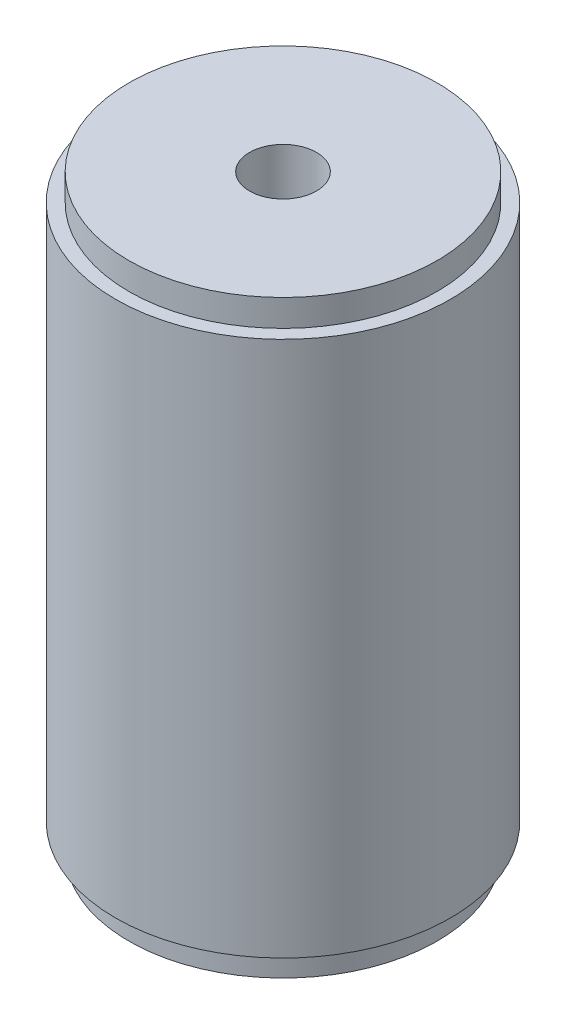
ISO-10303-21;
HEADER;
FILE_DESCRIPTION(('STEP AP214'),'2;1');
FILE_NAME('part.step','',(''),(''),'','','');
FILE_SCHEMA(('AUTOMOTIVE_DESIGN { 1 0 10303 214 1 1 1 1 }'));
ENDSEC;
DATA;
#1=APPLICATION_CONTEXT('core data for automotive mechanical design processes');
#2=APPLICATION_PROTOCOL_DEFINITION('international standard','automotive_design',2000,#1);
#3=PRODUCT_CONTEXT('',#1,'mechanical');
#4=PRODUCT('Part','Part','',(#3));
#5=PRODUCT_RELATED_PRODUCT_CATEGORY('part','',(#4));
#6=PRODUCT_DEFINITION_FORMATION('','',#4);
#7=PRODUCT_DEFINITION_CONTEXT('part definition',#1,'design');
#8=PRODUCT_DEFINITION('design','',#6,#7);
#9=PRODUCT_DEFINITION_SHAPE('','',#8);
#10=(LENGTH_UNIT() NAMED_UNIT(*) SI_UNIT(.MILLI.,.METRE.));
#11=(NAMED_UNIT(*) PLANE_ANGLE_UNIT() SI_UNIT($,.RADIAN.));
#12=(NAMED_UNIT(*) SI_UNIT($,.STERADIAN.) SOLID_ANGLE_UNIT());
#13=UNCERTAINTY_MEASURE_WITH_UNIT(LENGTH_MEASURE(1.E-05),#10,'distance_accuracy_value','');
#14=(GEOMETRIC_REPRESENTATION_CONTEXT(3) GLOBAL_UNCERTAINTY_ASSIGNED_CONTEXT((#13)) GLOBAL_UNIT_ASSIGNED_CONTEXT((#10,
#11,#12)) REPRESENTATION_CONTEXT('',''));
#15=CARTESIAN_POINT('',(0.,0.,0.));
#16=DIRECTION('',(0.,0.,1.));
#17=DIRECTION('',(1.,0.,0.));
#18=AXIS2_PLACEMENT_3D('',#15,#16,#17);
#19=CARTESIAN_POINT('',(0.,40.,0.));
#20=DIRECTION('',(0.,-1.,0.));
#21=DIRECTION('',(0.,0.,-1.));
#22=AXIS2_PLACEMENT_3D('',#19,#20,#21);
#23=CYLINDRICAL_SURFACE('',#22,12.5);
#24=CARTESIAN_POINT('',(0.,40.,0.));
#25=DIRECTION('',(0.,1.,0.));
#26=DIRECTION('',(0.,0.,1.));
#27=AXIS2_PLACEMENT_3D('',#24,#25,#26);
#28=CIRCLE('',#27,12.5);
#29=CARTESIAN_POINT('',(0.,40.,12.5));
#30=VERTEX_POINT('',#29);
#31=EDGE_CURVE('E51',#30,#30,#28,.T.);
#32=ORIENTED_EDGE('',*,*,#31,.F.);
#33=EDGE_LOOP('',(#32));
#34=FACE_BOUND('',#33,.T.);
#35=CARTESIAN_POINT('',(0.,0.,0.));
#36=DIRECTION('',(0.,1.,0.));
#37=DIRECTION('',(0.,0.,1.));
#38=AXIS2_PLACEMENT_3D('',#35,#36,#37);
#39=CIRCLE('',#38,12.5);
#40=CARTESIAN_POINT('',(0.,0.,12.5));
#41=VERTEX_POINT('',#40);
#42=EDGE_CURVE('E60',#41,#41,#39,.T.);
#43=ORIENTED_EDGE('',*,*,#42,.T.);
#44=EDGE_LOOP('',(#43));
#45=FACE_BOUND('',#44,.T.);
#46=ADVANCED_FACE('F37',(#34,#45),#23,.T.);
#47=CARTESIAN_POINT('',(0.,40.,0.));
#48=DIRECTION('',(0.,1.,0.));
#49=DIRECTION('',(0.,0.,1.));
#50=AXIS2_PLACEMENT_3D('',#47,#48,#49);
#51=PLANE('',#50);
#52=CARTESIAN_POINT('',(0.,40.,0.));
#53=DIRECTION('',(0.,1.,0.));
#54=DIRECTION('',(0.,0.,1.));
#55=AXIS2_PLACEMENT_3D('',#52,#53,#54);
#56=CIRCLE('',#55,11.5);
#57=CARTESIAN_POINT('',(0.,40.,11.5));
#58=VERTEX_POINT('',#57);
#59=EDGE_CURVE('E45',#58,#58,#56,.T.);
#60=ORIENTED_EDGE('',*,*,#59,.F.);
#61=EDGE_LOOP('',(#60));
#62=FACE_BOUND('',#61,.T.);
#63=ORIENTED_EDGE('',*,*,#31,.T.);
#64=EDGE_LOOP('',(#63));
#65=FACE_BOUND('',#64,.T.);
#66=ADVANCED_FACE('F72',(#62,#65),#51,.T.);
#67=CARTESIAN_POINT('',(0.,0.,0.));
#68=DIRECTION('',(0.,1.,0.));
#69=DIRECTION('',(0.,0.,1.));
#70=AXIS2_PLACEMENT_3D('',#67,#68,#69);
#71=PLANE('',#70);
#72=CARTESIAN_POINT('',(0.,0.,0.));
#73=DIRECTION('',(0.,-1.,0.));
#74=DIRECTION('',(0.,0.,-1.));
#75=AXIS2_PLACEMENT_3D('',#72,#73,#74);
#76=CIRCLE('',#75,11.5);
#77=CARTESIAN_POINT('',(0.,0.,-11.5));
#78=VERTEX_POINT('',#77);
#79=EDGE_CURVE('E10',#78,#78,#76,.T.);
#80=ORIENTED_EDGE('',*,*,#79,.F.);
#81=EDGE_LOOP('',(#80));
#82=FACE_BOUND('',#81,.T.);
#83=ORIENTED_EDGE('',*,*,#42,.F.);
#84=EDGE_LOOP('',(#83));
#85=FACE_BOUND('',#84,.T.);
#86=ADVANCED_FACE('F69',(#82,#85),#71,.F.);
#87=CARTESIAN_POINT('',(0.,42.,0.));
#88=DIRECTION('',(0.,-1.,0.));
#89=DIRECTION('',(0.,0.,-1.));
#90=AXIS2_PLACEMENT_3D('',#87,#88,#89);
#91=CYLINDRICAL_SURFACE('',#90,11.5);
#92=CARTESIAN_POINT('',(0.,42.,0.));
#93=DIRECTION('',(0.,1.,0.));
#94=DIRECTION('',(0.,0.,1.));
#95=AXIS2_PLACEMENT_3D('',#92,#93,#94);
#96=CIRCLE('',#95,11.5);
#97=CARTESIAN_POINT('',(0.,42.,11.5));
#98=VERTEX_POINT('',#97);
#99=EDGE_CURVE('E57',#98,#98,#96,.T.);
#100=ORIENTED_EDGE('',*,*,#99,.F.);
#101=EDGE_LOOP('',(#100));
#102=FACE_BOUND('',#101,.T.);
#103=ORIENTED_EDGE('',*,*,#59,.T.);
#104=EDGE_LOOP('',(#103));
#105=FACE_BOUND('',#104,.T.);
#106=ADVANCED_FACE('F71',(#102,#105),#91,.T.);
#107=CARTESIAN_POINT('',(0.,42.,0.));
#108=DIRECTION('',(0.,1.,0.));
#109=DIRECTION('',(0.,0.,1.));
#110=AXIS2_PLACEMENT_3D('',#107,#108,#109);
#111=PLANE('',#110);
#112=CARTESIAN_POINT('',(0.,42.,0.));
#113=DIRECTION('',(0.,-1.,0.));
#114=DIRECTION('',(0.,0.,-1.));
#115=AXIS2_PLACEMENT_3D('',#112,#113,#114);
#116=CIRCLE('',#115,2.5);
#117=CARTESIAN_POINT('',(0.,42.,-2.5));
#118=VERTEX_POINT('',#117);
#119=EDGE_CURVE('E151',#118,#118,#116,.T.);
#120=ORIENTED_EDGE('',*,*,#119,.T.);
#121=EDGE_LOOP('',(#120));
#122=FACE_BOUND('',#121,.T.);
#123=ORIENTED_EDGE('',*,*,#99,.T.);
#124=EDGE_LOOP('',(#123));
#125=FACE_BOUND('',#124,.T.);
#126=ADVANCED_FACE('F78',(#122,#125),#111,.T.);
#127=CARTESIAN_POINT('',(0.,-2.,0.));
#128=DIRECTION('',(0.,1.,0.));
#129=DIRECTION('',(0.,0.,1.));
#130=AXIS2_PLACEMENT_3D('',#127,#128,#129);
#131=CYLINDRICAL_SURFACE('',#130,11.5);
#132=CARTESIAN_POINT('',(0.,-2.,0.));
#133=DIRECTION('',(0.,-1.,0.));
#134=DIRECTION('',(0.,0.,-1.));
#135=AXIS2_PLACEMENT_3D('',#132,#133,#134);
#136=CIRCLE('',#135,11.5);
#137=CARTESIAN_POINT('',(0.,-2.,-11.5));
#138=VERTEX_POINT('',#137);
#139=EDGE_CURVE('E55',#138,#138,#136,.T.);
#140=ORIENTED_EDGE('',*,*,#139,.F.);
#141=EDGE_LOOP('',(#140));
#142=FACE_BOUND('',#141,.T.);
#143=ORIENTED_EDGE('',*,*,#79,.T.);
#144=EDGE_LOOP('',(#143));
#145=FACE_BOUND('',#144,.T.);
#146=ADVANCED_FACE('F110',(#142,#145),#131,.T.);
#147=CARTESIAN_POINT('',(0.,-2.,0.));
#148=DIRECTION('',(0.,-1.,0.));
#149=DIRECTION('',(0.,0.,-1.));
#150=AXIS2_PLACEMENT_3D('',#147,#148,#149);
#151=PLANE('',#150);
#152=CARTESIAN_POINT('',(0.,-2.,0.));
#153=DIRECTION('',(0.,-1.,0.));
#154=DIRECTION('',(0.,0.,-1.));
#155=AXIS2_PLACEMENT_3D('',#152,#153,#154);
#156=CIRCLE('',#155,2.5);
#157=CARTESIAN_POINT('',(0.,-2.,-2.5));
#158=VERTEX_POINT('',#157);
#159=EDGE_CURVE('E40',#158,#158,#156,.T.);
#160=ORIENTED_EDGE('',*,*,#159,.F.);
#161=EDGE_LOOP('',(#160));
#162=FACE_BOUND('',#161,.T.);
#163=ORIENTED_EDGE('',*,*,#139,.T.);
#164=EDGE_LOOP('',(#163));
#165=FACE_BOUND('',#164,.T.);
#166=ADVANCED_FACE('F115',(#162,#165),#151,.T.);
#167=CARTESIAN_POINT('',(0.,42.,0.));
#168=DIRECTION('',(0.,-1.,0.));
#169=DIRECTION('',(0.,0.,-1.));
#170=AXIS2_PLACEMENT_3D('',#167,#168,#169);
#171=CYLINDRICAL_SURFACE('',#170,2.5);
#172=ORIENTED_EDGE('',*,*,#159,.T.);
#173=EDGE_LOOP('',(#172));
#174=FACE_BOUND('',#173,.T.);
#175=ORIENTED_EDGE('',*,*,#119,.F.);
#176=EDGE_LOOP('',(#175));
#177=FACE_BOUND('',#176,.T.);
#178=ADVANCED_FACE('F132',(#174,#177),#171,.F.);
#179=CLOSED_SHELL('',(#46,#66,#86,#106,#126,#146,#166,#178));
#180=MANIFOLD_SOLID_BREP('B2',#179);
#181=ADVANCED_BREP_SHAPE_REPRESENTATION('',(#18,#180),#14);
#182=SHAPE_DEFINITION_REPRESENTATION(#9,#181);
ENDSEC;
END-ISO-10303-21;
